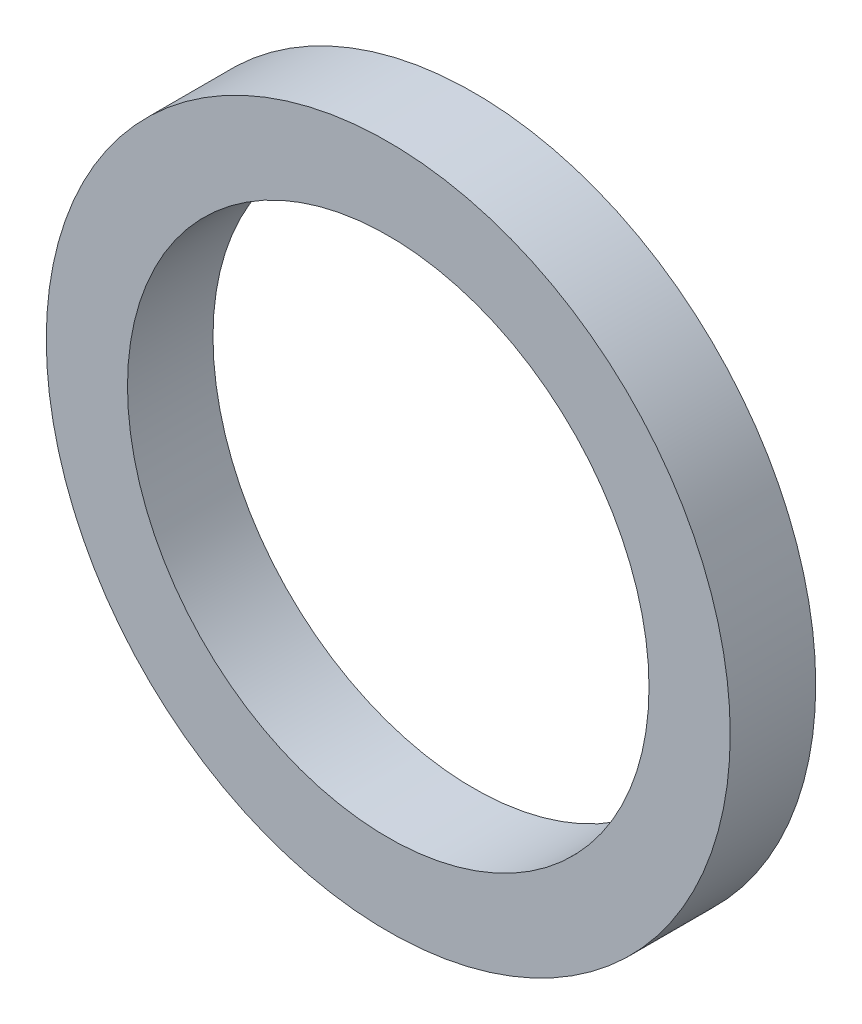
ISO-10303-21;
HEADER;
FILE_DESCRIPTION(('STEP AP214'),'2;1');
FILE_NAME('part.step','',(''),(''),'','','');
FILE_SCHEMA(('AUTOMOTIVE_DESIGN { 1 0 10303 214 1 1 1 1 }'));
ENDSEC;
DATA;
#1=APPLICATION_CONTEXT('core data for automotive mechanical design processes');
#2=APPLICATION_PROTOCOL_DEFINITION('international standard','automotive_design',2000,#1);
#3=PRODUCT_CONTEXT('',#1,'mechanical');
#4=PRODUCT('Part','Part','',(#3));
#5=PRODUCT_RELATED_PRODUCT_CATEGORY('part','',(#4));
#6=PRODUCT_DEFINITION_FORMATION('','',#4);
#7=PRODUCT_DEFINITION_CONTEXT('part definition',#1,'design');
#8=PRODUCT_DEFINITION('design','',#6,#7);
#9=PRODUCT_DEFINITION_SHAPE('','',#8);
#10=(LENGTH_UNIT() NAMED_UNIT(*) SI_UNIT(.MILLI.,.METRE.));
#11=(NAMED_UNIT(*) PLANE_ANGLE_UNIT() SI_UNIT($,.RADIAN.));
#12=(NAMED_UNIT(*) SI_UNIT($,.STERADIAN.) SOLID_ANGLE_UNIT());
#13=UNCERTAINTY_MEASURE_WITH_UNIT(LENGTH_MEASURE(1.E-05),#10,'distance_accuracy_value','');
#14=(GEOMETRIC_REPRESENTATION_CONTEXT(3) GLOBAL_UNCERTAINTY_ASSIGNED_CONTEXT((#13)) GLOBAL_UNIT_ASSIGNED_CONTEXT((#10,
#11,#12)) REPRESENTATION_CONTEXT('',''));
#15=CARTESIAN_POINT('',(0.,0.,0.));
#16=DIRECTION('',(0.,0.,1.));
#17=DIRECTION('',(1.,0.,0.));
#18=AXIS2_PLACEMENT_3D('',#15,#16,#17);
#19=CARTESIAN_POINT('',(0.,0.,-1.));
#20=DIRECTION('',(0.,0.,1.));
#21=DIRECTION('',(1.,0.,0.));
#22=AXIS2_PLACEMENT_3D('',#19,#20,#21);
#23=CYLINDRICAL_SURFACE('',#22,4.);
#24=CARTESIAN_POINT('',(0.,0.,-1.));
#25=DIRECTION('',(0.,0.,1.));
#26=DIRECTION('',(1.,0.,0.));
#27=AXIS2_PLACEMENT_3D('',#24,#25,#26);
#28=CIRCLE('',#27,4.);
#29=CARTESIAN_POINT('',(4.,0.,-1.));
#30=VERTEX_POINT('',#29);
#31=EDGE_CURVE('E10',#30,#30,#28,.T.);
#32=ORIENTED_EDGE('',*,*,#31,.T.);
#33=EDGE_LOOP('',(#32));
#34=FACE_BOUND('',#33,.T.);
#35=CARTESIAN_POINT('',(0.,0.,0.));
#36=DIRECTION('',(0.,0.,1.));
#37=DIRECTION('',(1.,0.,0.));
#38=AXIS2_PLACEMENT_3D('',#35,#36,#37);
#39=CIRCLE('',#38,4.);
#40=CARTESIAN_POINT('',(4.,0.,0.));
#41=VERTEX_POINT('',#40);
#42=EDGE_CURVE('E34',#41,#41,#39,.T.);
#43=ORIENTED_EDGE('',*,*,#42,.F.);
#44=EDGE_LOOP('',(#43));
#45=FACE_BOUND('',#44,.T.);
#46=ADVANCED_FACE('F31',(#34,#45),#23,.T.);
#47=CARTESIAN_POINT('',(0.,0.,-1.));
#48=DIRECTION('',(0.,0.,1.));
#49=DIRECTION('',(1.,0.,0.));
#50=AXIS2_PLACEMENT_3D('',#47,#48,#49);
#51=PLANE('',#50);
#52=CARTESIAN_POINT('',(0.,0.,-1.));
#53=DIRECTION('',(0.,0.,1.));
#54=DIRECTION('',(1.,0.,0.));
#55=AXIS2_PLACEMENT_3D('',#52,#53,#54);
#56=CIRCLE('',#55,3.05);
#57=CARTESIAN_POINT('',(3.05,0.,-1.));
#58=VERTEX_POINT('',#57);
#59=EDGE_CURVE('E41',#58,#58,#56,.T.);
#60=ORIENTED_EDGE('',*,*,#59,.T.);
#61=EDGE_LOOP('',(#60));
#62=FACE_BOUND('',#61,.T.);
#63=ORIENTED_EDGE('',*,*,#31,.F.);
#64=EDGE_LOOP('',(#63));
#65=FACE_BOUND('',#64,.T.);
#66=ADVANCED_FACE('F49',(#62,#65),#51,.F.);
#67=CARTESIAN_POINT('',(0.,0.,0.));
#68=DIRECTION('',(0.,0.,1.));
#69=DIRECTION('',(1.,0.,0.));
#70=AXIS2_PLACEMENT_3D('',#67,#68,#69);
#71=PLANE('',#70);
#72=CARTESIAN_POINT('',(0.,0.,0.));
#73=DIRECTION('',(0.,0.,1.));
#74=DIRECTION('',(1.,0.,0.));
#75=AXIS2_PLACEMENT_3D('',#72,#73,#74);
#76=CIRCLE('',#75,3.05);
#77=CARTESIAN_POINT('',(3.05,0.,0.));
#78=VERTEX_POINT('',#77);
#79=EDGE_CURVE('E43',#78,#78,#76,.T.);
#80=ORIENTED_EDGE('',*,*,#79,.F.);
#81=EDGE_LOOP('',(#80));
#82=FACE_BOUND('',#81,.T.);
#83=ORIENTED_EDGE('',*,*,#42,.T.);
#84=EDGE_LOOP('',(#83));
#85=FACE_BOUND('',#84,.T.);
#86=ADVANCED_FACE('F55',(#82,#85),#71,.T.);
#87=CARTESIAN_POINT('',(0.,0.,-1.));
#88=DIRECTION('',(0.,0.,1.));
#89=DIRECTION('',(1.,0.,0.));
#90=AXIS2_PLACEMENT_3D('',#87,#88,#89);
#91=CYLINDRICAL_SURFACE('',#90,3.05);
#92=ORIENTED_EDGE('',*,*,#59,.F.);
#93=EDGE_LOOP('',(#92));
#94=FACE_BOUND('',#93,.T.);
#95=ORIENTED_EDGE('',*,*,#79,.T.);
#96=EDGE_LOOP('',(#95));
#97=FACE_BOUND('',#96,.T.);
#98=ADVANCED_FACE('F52',(#94,#97),#91,.F.);
#99=CLOSED_SHELL('',(#46,#66,#86,#98));
#100=MANIFOLD_SOLID_BREP('B2',#99);
#101=ADVANCED_BREP_SHAPE_REPRESENTATION('',(#18,#100),#14);
#102=SHAPE_DEFINITION_REPRESENTATION(#9,#101);
ENDSEC;
END-ISO-10303-21;
